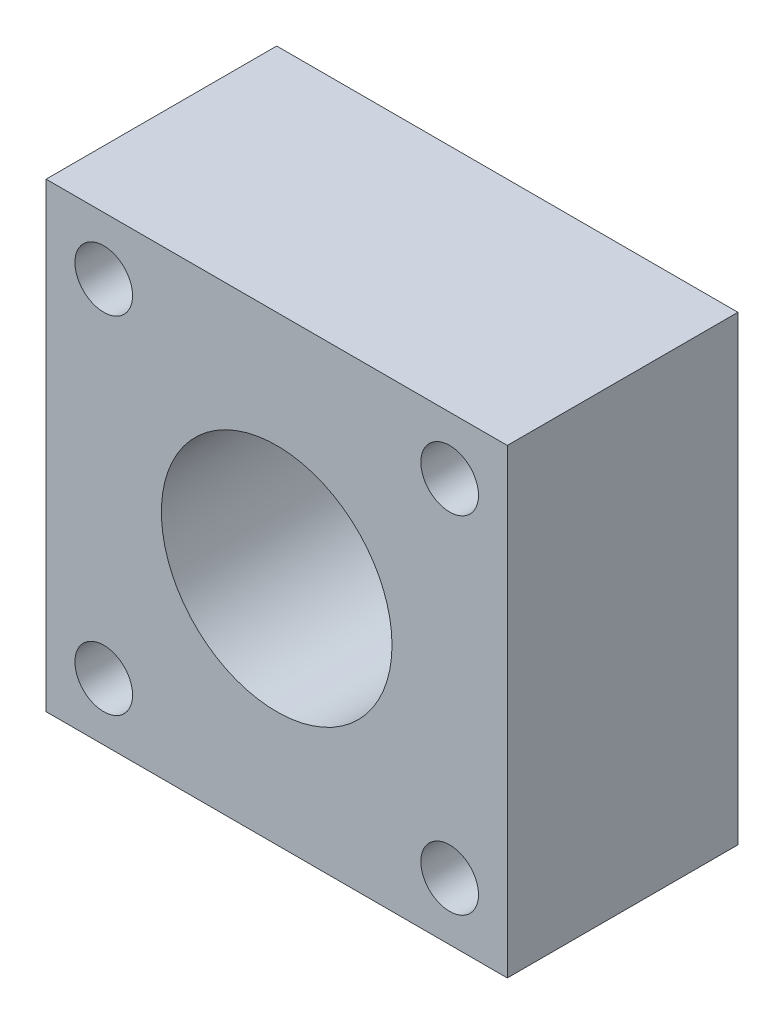
ISO-10303-21;
HEADER;
FILE_DESCRIPTION(('STEP AP214'),'2;1');
FILE_NAME('part.step','',(''),(''),'','','');
FILE_SCHEMA(('AUTOMOTIVE_DESIGN { 1 0 10303 214 1 1 1 1 }'));
ENDSEC;
DATA;
#1=APPLICATION_CONTEXT('core data for automotive mechanical design processes');
#2=APPLICATION_PROTOCOL_DEFINITION('international standard','automotive_design',2000,#1);
#3=PRODUCT_CONTEXT('',#1,'mechanical');
#4=PRODUCT('Part','Part','',(#3));
#5=PRODUCT_RELATED_PRODUCT_CATEGORY('part','',(#4));
#6=PRODUCT_DEFINITION_FORMATION('','',#4);
#7=PRODUCT_DEFINITION_CONTEXT('part definition',#1,'design');
#8=PRODUCT_DEFINITION('design','',#6,#7);
#9=PRODUCT_DEFINITION_SHAPE('','',#8);
#10=(LENGTH_UNIT() NAMED_UNIT(*) SI_UNIT(.MILLI.,.METRE.));
#11=(NAMED_UNIT(*) PLANE_ANGLE_UNIT() SI_UNIT($,.RADIAN.));
#12=(NAMED_UNIT(*) SI_UNIT($,.STERADIAN.) SOLID_ANGLE_UNIT());
#13=UNCERTAINTY_MEASURE_WITH_UNIT(LENGTH_MEASURE(1.E-05),#10,'distance_accuracy_value','');
#14=(GEOMETRIC_REPRESENTATION_CONTEXT(3) GLOBAL_UNCERTAINTY_ASSIGNED_CONTEXT((#13)) GLOBAL_UNIT_ASSIGNED_CONTEXT((#10,
#11,#12)) REPRESENTATION_CONTEXT('',''));
#15=CARTESIAN_POINT('',(0.,0.,0.));
#16=DIRECTION('',(0.,0.,1.));
#17=DIRECTION('',(1.,0.,0.));
#18=AXIS2_PLACEMENT_3D('',#15,#16,#17);
#19=CARTESIAN_POINT('',(25.4,25.4,25.4));
#20=DIRECTION('',(-1.,0.,0.));
#21=DIRECTION('',(0.,-1.,0.));
#22=AXIS2_PLACEMENT_3D('',#19,#20,#21);
#23=PLANE('',#22);
#24=DIRECTION('',(0.,1.,0.));
#25=VECTOR('',#24,1.);
#26=CARTESIAN_POINT('',(25.4,25.4,0.));
#27=LINE('',#26,#25);
#28=CARTESIAN_POINT('',(25.4,-25.4,0.));
#29=VERTEX_POINT('',#28);
#30=CARTESIAN_POINT('',(25.4,25.4,0.));
#31=VERTEX_POINT('',#30);
#32=EDGE_CURVE('E94',#29,#31,#27,.T.);
#33=ORIENTED_EDGE('',*,*,#32,.T.);
#34=DIRECTION('',(0.,0.,-1.));
#35=VECTOR('',#34,1.);
#36=CARTESIAN_POINT('',(25.4,25.4,25.4));
#37=LINE('',#36,#35);
#38=CARTESIAN_POINT('',(25.4,25.4,25.4));
#39=VERTEX_POINT('',#38);
#40=EDGE_CURVE('E11',#39,#31,#37,.T.);
#41=ORIENTED_EDGE('',*,*,#40,.F.);
#42=DIRECTION('',(0.,1.,0.));
#43=VECTOR('',#42,1.);
#44=CARTESIAN_POINT('',(25.4,25.4,25.4));
#45=LINE('',#44,#43);
#46=CARTESIAN_POINT('',(25.4,-25.4,25.4));
#47=VERTEX_POINT('',#46);
#48=EDGE_CURVE('E82',#47,#39,#45,.T.);
#49=ORIENTED_EDGE('',*,*,#48,.F.);
#50=DIRECTION('',(0.,0.,-1.));
#51=VECTOR('',#50,1.);
#52=CARTESIAN_POINT('',(25.4,-25.4,25.4));
#53=LINE('',#52,#51);
#54=EDGE_CURVE('E90',#47,#29,#53,.T.);
#55=ORIENTED_EDGE('',*,*,#54,.T.);
#56=EDGE_LOOP('',(#33,#41,#49,#55));
#57=FACE_BOUND('',#56,.T.);
#58=ADVANCED_FACE('F31',(#57),#23,.F.);
#59=CARTESIAN_POINT('',(-25.4,25.4,25.4));
#60=DIRECTION('',(0.,-1.,0.));
#61=DIRECTION('',(0.,0.,-1.));
#62=AXIS2_PLACEMENT_3D('',#59,#60,#61);
#63=PLANE('',#62);
#64=DIRECTION('',(-1.,0.,0.));
#65=VECTOR('',#64,1.);
#66=CARTESIAN_POINT('',(-25.4,25.4,0.));
#67=LINE('',#66,#65);
#68=CARTESIAN_POINT('',(-25.4,25.4,0.));
#69=VERTEX_POINT('',#68);
#70=EDGE_CURVE('E86',#31,#69,#67,.T.);
#71=ORIENTED_EDGE('',*,*,#70,.T.);
#72=DIRECTION('',(0.,0.,-1.));
#73=VECTOR('',#72,1.);
#74=CARTESIAN_POINT('',(-25.4,25.4,25.4));
#75=LINE('',#74,#73);
#76=CARTESIAN_POINT('',(-25.4,25.4,25.4));
#77=VERTEX_POINT('',#76);
#78=EDGE_CURVE('E39',#77,#69,#75,.T.);
#79=ORIENTED_EDGE('',*,*,#78,.F.);
#80=DIRECTION('',(-1.,0.,0.));
#81=VECTOR('',#80,1.);
#82=CARTESIAN_POINT('',(-25.4,25.4,25.4));
#83=LINE('',#82,#81);
#84=EDGE_CURVE('E77',#39,#77,#83,.T.);
#85=ORIENTED_EDGE('',*,*,#84,.F.);
#86=ORIENTED_EDGE('',*,*,#40,.T.);
#87=EDGE_LOOP('',(#71,#79,#85,#86));
#88=FACE_BOUND('',#87,.T.);
#89=ADVANCED_FACE('F85',(#88),#63,.F.);
#90=CARTESIAN_POINT('',(-25.4,25.4,25.4));
#91=DIRECTION('',(1.,0.,0.));
#92=DIRECTION('',(0.,1.,0.));
#93=AXIS2_PLACEMENT_3D('',#90,#91,#92);
#94=PLANE('',#93);
#95=DIRECTION('',(0.,-1.,0.));
#96=VECTOR('',#95,1.);
#97=CARTESIAN_POINT('',(-25.4,25.4,0.));
#98=LINE('',#97,#96);
#99=CARTESIAN_POINT('',(-25.4,-25.4,0.));
#100=VERTEX_POINT('',#99);
#101=EDGE_CURVE('E64',#69,#100,#98,.T.);
#102=ORIENTED_EDGE('',*,*,#101,.T.);
#103=DIRECTION('',(0.,0.,-1.));
#104=VECTOR('',#103,1.);
#105=CARTESIAN_POINT('',(-25.4,-25.4,25.4));
#106=LINE('',#105,#104);
#107=CARTESIAN_POINT('',(-25.4,-25.4,25.4));
#108=VERTEX_POINT('',#107);
#109=EDGE_CURVE('E87',#108,#100,#106,.T.);
#110=ORIENTED_EDGE('',*,*,#109,.F.);
#111=DIRECTION('',(0.,-1.,0.));
#112=VECTOR('',#111,1.);
#113=CARTESIAN_POINT('',(-25.4,25.4,25.4));
#114=LINE('',#113,#112);
#115=EDGE_CURVE('E80',#77,#108,#114,.T.);
#116=ORIENTED_EDGE('',*,*,#115,.F.);
#117=ORIENTED_EDGE('',*,*,#78,.T.);
#118=EDGE_LOOP('',(#102,#110,#116,#117));
#119=FACE_BOUND('',#118,.T.);
#120=ADVANCED_FACE('F88',(#119),#94,.F.);
#121=CARTESIAN_POINT('',(-25.4,-25.4,25.4));
#122=DIRECTION('',(0.,1.,0.));
#123=DIRECTION('',(0.,0.,1.));
#124=AXIS2_PLACEMENT_3D('',#121,#122,#123);
#125=PLANE('',#124);
#126=DIRECTION('',(1.,0.,0.));
#127=VECTOR('',#126,1.);
#128=CARTESIAN_POINT('',(-25.4,-25.4,0.));
#129=LINE('',#128,#127);
#130=EDGE_CURVE('E70',#100,#29,#129,.T.);
#131=ORIENTED_EDGE('',*,*,#130,.T.);
#132=ORIENTED_EDGE('',*,*,#54,.F.);
#133=DIRECTION('',(1.,0.,0.));
#134=VECTOR('',#133,1.);
#135=CARTESIAN_POINT('',(-25.4,-25.4,25.4));
#136=LINE('',#135,#134);
#137=EDGE_CURVE('E47',#108,#47,#136,.T.);
#138=ORIENTED_EDGE('',*,*,#137,.F.);
#139=ORIENTED_EDGE('',*,*,#109,.T.);
#140=EDGE_LOOP('',(#131,#132,#138,#139));
#141=FACE_BOUND('',#140,.T.);
#142=ADVANCED_FACE('F102',(#141),#125,.F.);
#143=CARTESIAN_POINT('',(25.4,-25.4,25.4));
#144=DIRECTION('',(0.,0.,1.));
#145=DIRECTION('',(1.,0.,0.));
#146=AXIS2_PLACEMENT_3D('',#143,#144,#145);
#147=PLANE('',#146);
#148=CARTESIAN_POINT('',(-19.0499999999996,-19.0500000000003,25.4));
#149=DIRECTION('',(0.,0.,1.));
#150=DIRECTION('',(1.,0.,0.));
#151=AXIS2_PLACEMENT_3D('',#148,#149,#150);
#152=CIRCLE('',#151,3.175);
#153=CARTESIAN_POINT('',(-15.8749999999996,-19.0500000000003,25.4));
#154=VERTEX_POINT('',#153);
#155=EDGE_CURVE('E132',#154,#154,#152,.T.);
#156=ORIENTED_EDGE('',*,*,#155,.F.);
#157=EDGE_LOOP('',(#156));
#158=FACE_BOUND('',#157,.T.);
#159=CARTESIAN_POINT('',(19.0500000000004,-19.05,25.4));
#160=DIRECTION('',(0.,0.,1.));
#161=DIRECTION('',(1.,0.,0.));
#162=AXIS2_PLACEMENT_3D('',#159,#160,#161);
#163=CIRCLE('',#162,3.175);
#164=CARTESIAN_POINT('',(22.2250000000004,-19.05,25.4));
#165=VERTEX_POINT('',#164);
#166=EDGE_CURVE('E126',#165,#165,#163,.T.);
#167=ORIENTED_EDGE('',*,*,#166,.F.);
#168=EDGE_LOOP('',(#167));
#169=FACE_BOUND('',#168,.T.);
#170=CARTESIAN_POINT('',(-19.05,19.0499999999997,25.4));
#171=DIRECTION('',(0.,0.,1.));
#172=DIRECTION('',(1.,0.,0.));
#173=AXIS2_PLACEMENT_3D('',#170,#171,#172);
#174=CIRCLE('',#173,3.175);
#175=CARTESIAN_POINT('',(-15.875,19.0499999999997,25.4));
#176=VERTEX_POINT('',#175);
#177=EDGE_CURVE('E120',#176,#176,#174,.T.);
#178=ORIENTED_EDGE('',*,*,#177,.F.);
#179=EDGE_LOOP('',(#178));
#180=FACE_BOUND('',#179,.T.);
#181=CARTESIAN_POINT('',(0.,0.,25.4));
#182=DIRECTION('',(0.,0.,1.));
#183=DIRECTION('',(1.,0.,0.));
#184=AXIS2_PLACEMENT_3D('',#181,#182,#183);
#185=CIRCLE('',#184,12.7);
#186=CARTESIAN_POINT('',(12.7,0.,25.4));
#187=VERTEX_POINT('',#186);
#188=EDGE_CURVE('E114',#187,#187,#185,.T.);
#189=ORIENTED_EDGE('',*,*,#188,.F.);
#190=EDGE_LOOP('',(#189));
#191=FACE_BOUND('',#190,.T.);
#192=CARTESIAN_POINT('',(19.05,19.05,25.4));
#193=DIRECTION('',(0.,0.,1.));
#194=DIRECTION('',(1.,0.,0.));
#195=AXIS2_PLACEMENT_3D('',#192,#193,#194);
#196=CIRCLE('',#195,3.175);
#197=CARTESIAN_POINT('',(22.225,19.05,25.4));
#198=VERTEX_POINT('',#197);
#199=EDGE_CURVE('E108',#198,#198,#196,.T.);
#200=ORIENTED_EDGE('',*,*,#199,.F.);
#201=EDGE_LOOP('',(#200));
#202=FACE_BOUND('',#201,.T.);
#203=ORIENTED_EDGE('',*,*,#48,.T.);
#204=ORIENTED_EDGE('',*,*,#84,.T.);
#205=ORIENTED_EDGE('',*,*,#115,.T.);
#206=ORIENTED_EDGE('',*,*,#137,.T.);
#207=EDGE_LOOP('',(#203,#204,#205,#206));
#208=FACE_BOUND('',#207,.T.);
#209=ADVANCED_FACE('F78',(#158,#169,#180,#191,#202,#208),#147,.T.);
#210=CARTESIAN_POINT('',(25.4,-25.4,0.));
#211=DIRECTION('',(0.,0.,1.));
#212=DIRECTION('',(1.,0.,0.));
#213=AXIS2_PLACEMENT_3D('',#210,#211,#212);
#214=PLANE('',#213);
#215=CARTESIAN_POINT('',(-19.0499999999996,-19.0500000000003,0.));
#216=DIRECTION('',(0.,0.,1.));
#217=DIRECTION('',(1.,0.,0.));
#218=AXIS2_PLACEMENT_3D('',#215,#216,#217);
#219=CIRCLE('',#218,3.175);
#220=CARTESIAN_POINT('',(-15.8749999999996,-19.0500000000003,0.));
#221=VERTEX_POINT('',#220);
#222=EDGE_CURVE('E129',#221,#221,#219,.T.);
#223=ORIENTED_EDGE('',*,*,#222,.T.);
#224=EDGE_LOOP('',(#223));
#225=FACE_BOUND('',#224,.T.);
#226=CARTESIAN_POINT('',(19.0500000000004,-19.05,0.));
#227=DIRECTION('',(0.,0.,1.));
#228=DIRECTION('',(1.,0.,0.));
#229=AXIS2_PLACEMENT_3D('',#226,#227,#228);
#230=CIRCLE('',#229,3.175);
#231=CARTESIAN_POINT('',(22.2250000000004,-19.05,0.));
#232=VERTEX_POINT('',#231);
#233=EDGE_CURVE('E123',#232,#232,#230,.T.);
#234=ORIENTED_EDGE('',*,*,#233,.T.);
#235=EDGE_LOOP('',(#234));
#236=FACE_BOUND('',#235,.T.);
#237=CARTESIAN_POINT('',(-19.05,19.0499999999997,0.));
#238=DIRECTION('',(0.,0.,1.));
#239=DIRECTION('',(1.,0.,0.));
#240=AXIS2_PLACEMENT_3D('',#237,#238,#239);
#241=CIRCLE('',#240,3.175);
#242=CARTESIAN_POINT('',(-15.875,19.0499999999997,0.));
#243=VERTEX_POINT('',#242);
#244=EDGE_CURVE('E117',#243,#243,#241,.T.);
#245=ORIENTED_EDGE('',*,*,#244,.T.);
#246=EDGE_LOOP('',(#245));
#247=FACE_BOUND('',#246,.T.);
#248=CARTESIAN_POINT('',(0.,0.,0.));
#249=DIRECTION('',(0.,0.,1.));
#250=DIRECTION('',(1.,0.,0.));
#251=AXIS2_PLACEMENT_3D('',#248,#249,#250);
#252=CIRCLE('',#251,12.7);
#253=CARTESIAN_POINT('',(12.7,0.,0.));
#254=VERTEX_POINT('',#253);
#255=EDGE_CURVE('E111',#254,#254,#252,.T.);
#256=ORIENTED_EDGE('',*,*,#255,.T.);
#257=EDGE_LOOP('',(#256));
#258=FACE_BOUND('',#257,.T.);
#259=CARTESIAN_POINT('',(19.05,19.05,0.));
#260=DIRECTION('',(0.,0.,1.));
#261=DIRECTION('',(1.,0.,0.));
#262=AXIS2_PLACEMENT_3D('',#259,#260,#261);
#263=CIRCLE('',#262,3.175);
#264=CARTESIAN_POINT('',(22.225,19.05,0.));
#265=VERTEX_POINT('',#264);
#266=EDGE_CURVE('E97',#265,#265,#263,.T.);
#267=ORIENTED_EDGE('',*,*,#266,.T.);
#268=EDGE_LOOP('',(#267));
#269=FACE_BOUND('',#268,.T.);
#270=ORIENTED_EDGE('',*,*,#32,.F.);
#271=ORIENTED_EDGE('',*,*,#130,.F.);
#272=ORIENTED_EDGE('',*,*,#101,.F.);
#273=ORIENTED_EDGE('',*,*,#70,.F.);
#274=EDGE_LOOP('',(#270,#271,#272,#273));
#275=FACE_BOUND('',#274,.T.);
#276=ADVANCED_FACE('F105',(#225,#236,#247,#258,#269,#275),#214,.F.);
#277=CARTESIAN_POINT('',(19.05,19.05,0.));
#278=DIRECTION('',(0.,0.,1.));
#279=DIRECTION('',(1.,0.,0.));
#280=AXIS2_PLACEMENT_3D('',#277,#278,#279);
#281=CYLINDRICAL_SURFACE('',#280,3.175);
#282=ORIENTED_EDGE('',*,*,#266,.F.);
#283=EDGE_LOOP('',(#282));
#284=FACE_BOUND('',#283,.T.);
#285=ORIENTED_EDGE('',*,*,#199,.T.);
#286=EDGE_LOOP('',(#285));
#287=FACE_BOUND('',#286,.T.);
#288=ADVANCED_FACE('F158',(#284,#287),#281,.F.);
#289=CARTESIAN_POINT('',(0.,0.,0.));
#290=DIRECTION('',(0.,0.,1.));
#291=DIRECTION('',(1.,0.,0.));
#292=AXIS2_PLACEMENT_3D('',#289,#290,#291);
#293=CYLINDRICAL_SURFACE('',#292,12.7);
#294=ORIENTED_EDGE('',*,*,#255,.F.);
#295=EDGE_LOOP('',(#294));
#296=FACE_BOUND('',#295,.T.);
#297=ORIENTED_EDGE('',*,*,#188,.T.);
#298=EDGE_LOOP('',(#297));
#299=FACE_BOUND('',#298,.T.);
#300=ADVANCED_FACE('F160',(#296,#299),#293,.F.);
#301=CARTESIAN_POINT('',(-19.05,19.0499999999997,0.));
#302=DIRECTION('',(0.,0.,1.));
#303=DIRECTION('',(1.,0.,0.));
#304=AXIS2_PLACEMENT_3D('',#301,#302,#303);
#305=CYLINDRICAL_SURFACE('',#304,3.175);
#306=ORIENTED_EDGE('',*,*,#244,.F.);
#307=EDGE_LOOP('',(#306));
#308=FACE_BOUND('',#307,.T.);
#309=ORIENTED_EDGE('',*,*,#177,.T.);
#310=EDGE_LOOP('',(#309));
#311=FACE_BOUND('',#310,.T.);
#312=ADVANCED_FACE('F167',(#308,#311),#305,.F.);
#313=CARTESIAN_POINT('',(19.0500000000004,-19.05,0.));
#314=DIRECTION('',(0.,0.,1.));
#315=DIRECTION('',(1.,0.,0.));
#316=AXIS2_PLACEMENT_3D('',#313,#314,#315);
#317=CYLINDRICAL_SURFACE('',#316,3.175);
#318=ORIENTED_EDGE('',*,*,#233,.F.);
#319=EDGE_LOOP('',(#318));
#320=FACE_BOUND('',#319,.T.);
#321=ORIENTED_EDGE('',*,*,#166,.T.);
#322=EDGE_LOOP('',(#321));
#323=FACE_BOUND('',#322,.T.);
#324=ADVANCED_FACE('F143',(#320,#323),#317,.F.);
#325=CARTESIAN_POINT('',(-19.0499999999996,-19.0500000000003,0.));
#326=DIRECTION('',(0.,0.,1.));
#327=DIRECTION('',(1.,0.,0.));
#328=AXIS2_PLACEMENT_3D('',#325,#326,#327);
#329=CYLINDRICAL_SURFACE('',#328,3.175);
#330=ORIENTED_EDGE('',*,*,#222,.F.);
#331=EDGE_LOOP('',(#330));
#332=FACE_BOUND('',#331,.T.);
#333=ORIENTED_EDGE('',*,*,#155,.T.);
#334=EDGE_LOOP('',(#333));
#335=FACE_BOUND('',#334,.T.);
#336=ADVANCED_FACE('F140',(#332,#335),#329,.F.);
#337=CLOSED_SHELL('',(#58,#89,#120,#142,#209,#276,#288,#300,#312,#324,#336));
#338=MANIFOLD_SOLID_BREP('B2',#337);
#339=ADVANCED_BREP_SHAPE_REPRESENTATION('',(#18,#338),#14);
#340=SHAPE_DEFINITION_REPRESENTATION(#9,#339);
ENDSEC;
END-ISO-10303-21;
